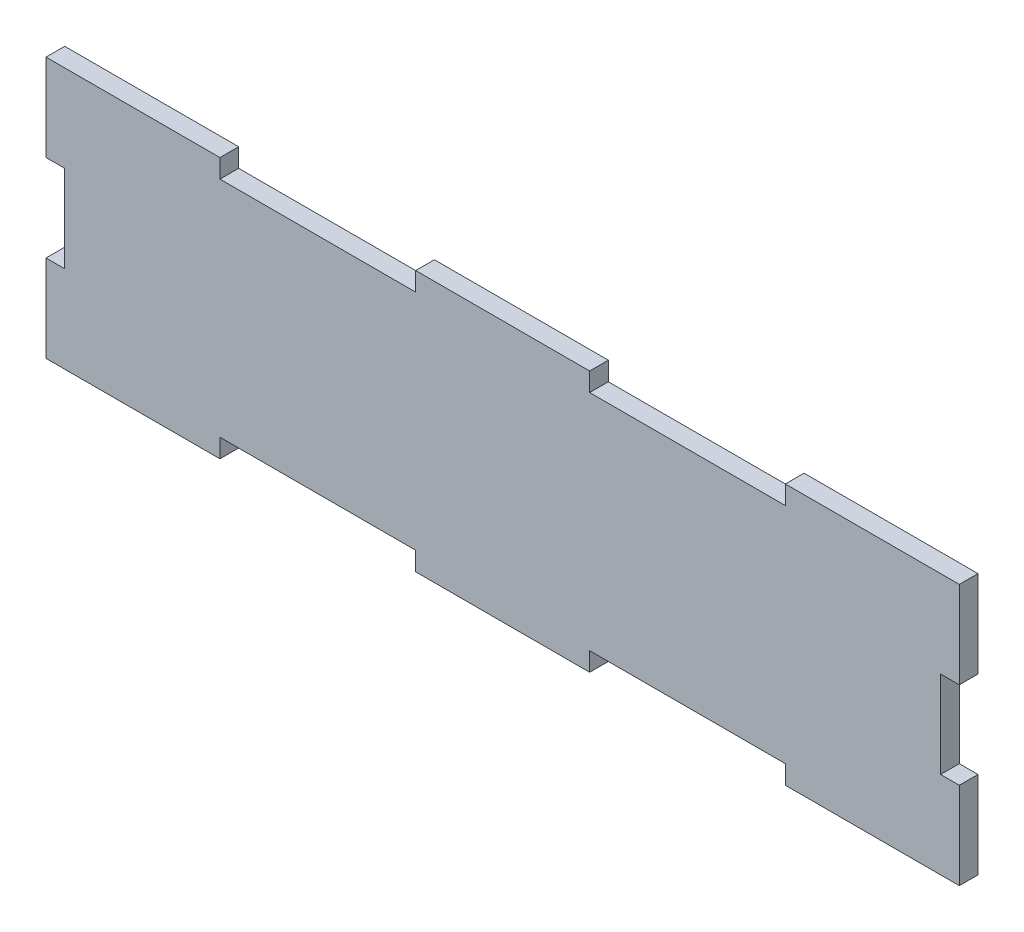
ISO-10303-21;
HEADER;
FILE_DESCRIPTION(('STEP AP214'),'2;1');
FILE_NAME('part.step','',(''),(''),'','','');
FILE_SCHEMA(('AUTOMOTIVE_DESIGN { 1 0 10303 214 1 1 1 1 }'));
ENDSEC;
DATA;
#1=APPLICATION_CONTEXT('core data for automotive mechanical design processes');
#2=APPLICATION_PROTOCOL_DEFINITION('international standard','automotive_design',2000,#1);
#3=PRODUCT_CONTEXT('',#1,'mechanical');
#4=PRODUCT('Part','Part','',(#3));
#5=PRODUCT_RELATED_PRODUCT_CATEGORY('part','',(#4));
#6=PRODUCT_DEFINITION_FORMATION('','',#4);
#7=PRODUCT_DEFINITION_CONTEXT('part definition',#1,'design');
#8=PRODUCT_DEFINITION('design','',#6,#7);
#9=PRODUCT_DEFINITION_SHAPE('','',#8);
#10=(LENGTH_UNIT() NAMED_UNIT(*) SI_UNIT(.MILLI.,.METRE.));
#11=(NAMED_UNIT(*) PLANE_ANGLE_UNIT() SI_UNIT($,.RADIAN.));
#12=(NAMED_UNIT(*) SI_UNIT($,.STERADIAN.) SOLID_ANGLE_UNIT());
#13=UNCERTAINTY_MEASURE_WITH_UNIT(LENGTH_MEASURE(1.E-05),#10,'distance_accuracy_value','');
#14=(GEOMETRIC_REPRESENTATION_CONTEXT(3) GLOBAL_UNCERTAINTY_ASSIGNED_CONTEXT((#13)) GLOBAL_UNIT_ASSIGNED_CONTEXT((#10,
#11,#12)) REPRESENTATION_CONTEXT('',''));
#15=CARTESIAN_POINT('',(0.,0.,0.));
#16=DIRECTION('',(0.,0.,1.));
#17=DIRECTION('',(1.,0.,0.));
#18=AXIS2_PLACEMENT_3D('',#15,#16,#17);
#19=CARTESIAN_POINT('',(0.,0.,2.7305));
#20=DIRECTION('',(0.,0.,1.));
#21=DIRECTION('',(1.,0.,0.));
#22=AXIS2_PLACEMENT_3D('',#19,#20,#21);
#23=PLANE('',#22);
#24=DIRECTION('',(0.,1.,0.));
#25=VECTOR('',#24,1.);
#26=CARTESIAN_POINT('',(133.35,38.1,2.7305));
#27=LINE('',#26,#25);
#28=CARTESIAN_POINT('',(133.35,-38.1,2.7305));
#29=VERTEX_POINT('',#28);
#30=CARTESIAN_POINT('',(133.35,-12.7,2.7305));
#31=VERTEX_POINT('',#30);
#32=EDGE_CURVE('E346',#29,#31,#27,.T.);
#33=ORIENTED_EDGE('',*,*,#32,.T.);
#34=DIRECTION('',(-1.,0.,0.));
#35=VECTOR('',#34,1.);
#36=CARTESIAN_POINT('',(133.35,-12.7,2.7305));
#37=LINE('',#36,#35);
#38=CARTESIAN_POINT('',(127.889,-12.7,2.7305));
#39=VERTEX_POINT('',#38);
#40=EDGE_CURVE('E232',#31,#39,#37,.T.);
#41=ORIENTED_EDGE('',*,*,#40,.T.);
#42=DIRECTION('',(0.,1.,0.));
#43=VECTOR('',#42,1.);
#44=CARTESIAN_POINT('',(127.889,12.7,2.7305));
#45=LINE('',#44,#43);
#46=CARTESIAN_POINT('',(127.889,12.7,2.7305));
#47=VERTEX_POINT('',#46);
#48=EDGE_CURVE('E404',#39,#47,#45,.T.);
#49=ORIENTED_EDGE('',*,*,#48,.T.);
#50=DIRECTION('',(1.,0.,0.));
#51=VECTOR('',#50,1.);
#52=CARTESIAN_POINT('',(133.35,12.7,2.7305));
#53=LINE('',#52,#51);
#54=CARTESIAN_POINT('',(133.35,12.7,2.7305));
#55=VERTEX_POINT('',#54);
#56=EDGE_CURVE('E402',#47,#55,#53,.T.);
#57=ORIENTED_EDGE('',*,*,#56,.T.);
#58=CARTESIAN_POINT('',(133.35,38.1,2.7305));
#59=VERTEX_POINT('',#58);
#60=EDGE_CURVE('E240',#55,#59,#27,.T.);
#61=ORIENTED_EDGE('',*,*,#60,.T.);
#62=DIRECTION('',(-1.,0.,0.));
#63=VECTOR('',#62,1.);
#64=CARTESIAN_POINT('',(-133.35,38.1,2.7305));
#65=LINE('',#64,#63);
#66=CARTESIAN_POINT('',(82.55,38.1,2.73050000000014));
#67=VERTEX_POINT('',#66);
#68=EDGE_CURVE('E350',#59,#67,#65,.T.);
#69=ORIENTED_EDGE('',*,*,#68,.T.);
#70=DIRECTION('',(0.,-1.,0.));
#71=VECTOR('',#70,1.);
#72=CARTESIAN_POINT('',(82.55,38.1,2.73050000000014));
#73=LINE('',#72,#71);
#74=CARTESIAN_POINT('',(82.55,32.639,2.73050000000013));
#75=VERTEX_POINT('',#74);
#76=EDGE_CURVE('E463',#67,#75,#73,.T.);
#77=ORIENTED_EDGE('',*,*,#76,.T.);
#78=DIRECTION('',(1.,0.,0.));
#79=VECTOR('',#78,1.);
#80=CARTESIAN_POINT('',(0.,32.639,2.73050000000013));
#81=LINE('',#80,#79);
#82=CARTESIAN_POINT('',(25.4,32.639,2.73050000000013));
#83=VERTEX_POINT('',#82);
#84=EDGE_CURVE('E458',#83,#75,#81,.T.);
#85=ORIENTED_EDGE('',*,*,#84,.F.);
#86=DIRECTION('',(0.,-1.,0.));
#87=VECTOR('',#86,1.);
#88=CARTESIAN_POINT('',(25.4,38.1,2.73050000000014));
#89=LINE('',#88,#87);
#90=CARTESIAN_POINT('',(25.4,38.1,2.73050000000014));
#91=VERTEX_POINT('',#90);
#92=EDGE_CURVE('E466',#91,#83,#89,.T.);
#93=ORIENTED_EDGE('',*,*,#92,.F.);
#94=CARTESIAN_POINT('',(-25.4,38.1,2.73050000000014));
#95=VERTEX_POINT('',#94);
#96=EDGE_CURVE('E353',#91,#95,#65,.T.);
#97=ORIENTED_EDGE('',*,*,#96,.T.);
#98=DIRECTION('',(0.,-1.,0.));
#99=VECTOR('',#98,1.);
#100=CARTESIAN_POINT('',(-25.4,38.1,2.73050000000014));
#101=LINE('',#100,#99);
#102=CARTESIAN_POINT('',(-25.4,32.639,2.73050000000013));
#103=VERTEX_POINT('',#102);
#104=EDGE_CURVE('E473',#95,#103,#101,.T.);
#105=ORIENTED_EDGE('',*,*,#104,.T.);
#106=DIRECTION('',(-1.,0.,0.));
#107=VECTOR('',#106,1.);
#108=CARTESIAN_POINT('',(0.,32.639,2.73050000000013));
#109=LINE('',#108,#107);
#110=CARTESIAN_POINT('',(-82.55,32.639,2.73050000000013));
#111=VERTEX_POINT('',#110);
#112=EDGE_CURVE('E449',#103,#111,#109,.T.);
#113=ORIENTED_EDGE('',*,*,#112,.T.);
#114=DIRECTION('',(0.,-1.,0.));
#115=VECTOR('',#114,1.);
#116=CARTESIAN_POINT('',(-82.55,38.1,2.73050000000014));
#117=LINE('',#116,#115);
#118=CARTESIAN_POINT('',(-82.55,38.1,2.73050000000014));
#119=VERTEX_POINT('',#118);
#120=EDGE_CURVE('E255',#119,#111,#117,.T.);
#121=ORIENTED_EDGE('',*,*,#120,.F.);
#122=CARTESIAN_POINT('',(-133.35,38.1,2.7305));
#123=VERTEX_POINT('',#122);
#124=EDGE_CURVE('E349',#119,#123,#65,.T.);
#125=ORIENTED_EDGE('',*,*,#124,.T.);
#126=DIRECTION('',(0.,-1.,0.));
#127=VECTOR('',#126,1.);
#128=CARTESIAN_POINT('',(-133.35,38.1,2.7305));
#129=LINE('',#128,#127);
#130=CARTESIAN_POINT('',(-133.35,12.7,2.7305));
#131=VERTEX_POINT('',#130);
#132=EDGE_CURVE('E354',#123,#131,#129,.T.);
#133=ORIENTED_EDGE('',*,*,#132,.T.);
#134=DIRECTION('',(-1.,0.,0.));
#135=VECTOR('',#134,1.);
#136=CARTESIAN_POINT('',(-133.35,12.7,2.7305));
#137=LINE('',#136,#135);
#138=CARTESIAN_POINT('',(-127.889,12.7,2.7305));
#139=VERTEX_POINT('',#138);
#140=EDGE_CURVE('E417',#139,#131,#137,.T.);
#141=ORIENTED_EDGE('',*,*,#140,.F.);
#142=DIRECTION('',(0.,1.,0.));
#143=VECTOR('',#142,1.);
#144=CARTESIAN_POINT('',(-127.889,12.7,2.7305));
#145=LINE('',#144,#143);
#146=CARTESIAN_POINT('',(-127.889,-12.7,2.7305));
#147=VERTEX_POINT('',#146);
#148=EDGE_CURVE('E424',#147,#139,#145,.T.);
#149=ORIENTED_EDGE('',*,*,#148,.F.);
#150=DIRECTION('',(1.,0.,0.));
#151=VECTOR('',#150,1.);
#152=CARTESIAN_POINT('',(-133.35,-12.7,2.7305));
#153=LINE('',#152,#151);
#154=CARTESIAN_POINT('',(-133.35,-12.7,2.7305));
#155=VERTEX_POINT('',#154);
#156=EDGE_CURVE('E369',#155,#147,#153,.T.);
#157=ORIENTED_EDGE('',*,*,#156,.F.);
#158=CARTESIAN_POINT('',(-133.35,-38.1,2.7305));
#159=VERTEX_POINT('',#158);
#160=EDGE_CURVE('E352',#155,#159,#129,.T.);
#161=ORIENTED_EDGE('',*,*,#160,.T.);
#162=DIRECTION('',(1.,0.,0.));
#163=VECTOR('',#162,1.);
#164=CARTESIAN_POINT('',(-133.35,-38.1,2.7305));
#165=LINE('',#164,#163);
#166=CARTESIAN_POINT('',(-82.55,-38.1,2.73050000000015));
#167=VERTEX_POINT('',#166);
#168=EDGE_CURVE('E259',#159,#167,#165,.T.);
#169=ORIENTED_EDGE('',*,*,#168,.T.);
#170=DIRECTION('',(0.,-1.,0.));
#171=VECTOR('',#170,1.);
#172=CARTESIAN_POINT('',(-82.55,-32.639,2.73050000000013));
#173=LINE('',#172,#171);
#174=CARTESIAN_POINT('',(-82.55,-32.639,2.73050000000013));
#175=VERTEX_POINT('',#174);
#176=EDGE_CURVE('E342',#175,#167,#173,.T.);
#177=ORIENTED_EDGE('',*,*,#176,.F.);
#178=DIRECTION('',(-1.,0.,0.));
#179=VECTOR('',#178,1.);
#180=CARTESIAN_POINT('',(0.,-32.639,2.73050000000013));
#181=LINE('',#180,#179);
#182=CARTESIAN_POINT('',(-25.4,-32.639,2.73050000000013));
#183=VERTEX_POINT('',#182);
#184=EDGE_CURVE('E309',#183,#175,#181,.T.);
#185=ORIENTED_EDGE('',*,*,#184,.F.);
#186=DIRECTION('',(0.,-1.,0.));
#187=VECTOR('',#186,1.);
#188=CARTESIAN_POINT('',(-25.4,-32.639,2.73050000000013));
#189=LINE('',#188,#187);
#190=CARTESIAN_POINT('',(-25.4,-38.1,2.73050000000015));
#191=VERTEX_POINT('',#190);
#192=EDGE_CURVE('E307',#183,#191,#189,.T.);
#193=ORIENTED_EDGE('',*,*,#192,.T.);
#194=CARTESIAN_POINT('',(25.4,-38.1,2.73050000000015));
#195=VERTEX_POINT('',#194);
#196=EDGE_CURVE('E360',#191,#195,#165,.T.);
#197=ORIENTED_EDGE('',*,*,#196,.T.);
#198=DIRECTION('',(0.,-1.,0.));
#199=VECTOR('',#198,1.);
#200=CARTESIAN_POINT('',(25.4,-32.639,2.73050000000013));
#201=LINE('',#200,#199);
#202=CARTESIAN_POINT('',(25.4,-32.639,2.73050000000013));
#203=VERTEX_POINT('',#202);
#204=EDGE_CURVE('E336',#203,#195,#201,.T.);
#205=ORIENTED_EDGE('',*,*,#204,.F.);
#206=DIRECTION('',(1.,0.,0.));
#207=VECTOR('',#206,1.);
#208=CARTESIAN_POINT('',(0.,-32.639,2.73050000000013));
#209=LINE('',#208,#207);
#210=CARTESIAN_POINT('',(82.55,-32.639,2.73050000000013));
#211=VERTEX_POINT('',#210);
#212=EDGE_CURVE('E311',#203,#211,#209,.T.);
#213=ORIENTED_EDGE('',*,*,#212,.T.);
#214=DIRECTION('',(0.,-1.,0.));
#215=VECTOR('',#214,1.);
#216=CARTESIAN_POINT('',(82.55,-32.639,2.73050000000013));
#217=LINE('',#216,#215);
#218=CARTESIAN_POINT('',(82.55,-38.1,2.73050000000015));
#219=VERTEX_POINT('',#218);
#220=EDGE_CURVE('E333',#211,#219,#217,.T.);
#221=ORIENTED_EDGE('',*,*,#220,.T.);
#222=EDGE_CURVE('E356',#219,#29,#165,.T.);
#223=ORIENTED_EDGE('',*,*,#222,.T.);
#224=EDGE_LOOP('',(#33,#41,#49,#57,#61,#69,#77,#85,#93,#97,#105,#113,#121,#125,#133,#141,#149,
#157,#161,#169,#177,#185,#193,#197,#205,#213,#221,#223));
#225=FACE_BOUND('',#224,.T.);
#226=ADVANCED_FACE('F41',(#225),#23,.T.);
#227=CARTESIAN_POINT('',(133.35,38.1,2.7305));
#228=DIRECTION('',(-1.,0.,0.));
#229=DIRECTION('',(0.,0.,1.));
#230=AXIS2_PLACEMENT_3D('',#227,#228,#229);
#231=PLANE('',#230);
#232=DIRECTION('',(0.,0.,1.));
#233=VECTOR('',#232,1.);
#234=CARTESIAN_POINT('',(133.35,-12.7,-2.7305));
#235=LINE('',#234,#233);
#236=CARTESIAN_POINT('',(133.35,-12.7,-2.7305));
#237=VERTEX_POINT('',#236);
#238=EDGE_CURVE('E409',#237,#31,#235,.T.);
#239=ORIENTED_EDGE('',*,*,#238,.T.);
#240=ORIENTED_EDGE('',*,*,#32,.F.);
#241=DIRECTION('',(0.,0.,-1.));
#242=VECTOR('',#241,1.);
#243=CARTESIAN_POINT('',(133.35,-38.1,2.7305));
#244=LINE('',#243,#242);
#245=CARTESIAN_POINT('',(133.35,-38.1,-2.7305));
#246=VERTEX_POINT('',#245);
#247=EDGE_CURVE('E272',#29,#246,#244,.T.);
#248=ORIENTED_EDGE('',*,*,#247,.T.);
#249=DIRECTION('',(0.,1.,0.));
#250=VECTOR('',#249,1.);
#251=CARTESIAN_POINT('',(133.35,38.1,-2.7305));
#252=LINE('',#251,#250);
#253=EDGE_CURVE('E249',#246,#237,#252,.T.);
#254=ORIENTED_EDGE('',*,*,#253,.T.);
#255=EDGE_LOOP('',(#239,#240,#248,#254));
#256=FACE_BOUND('',#255,.T.);
#257=ADVANCED_FACE('F43',(#256),#231,.F.);
#258=DIRECTION('',(0.,0.,1.));
#259=VECTOR('',#258,1.);
#260=CARTESIAN_POINT('',(133.35,12.7,-2.7305));
#261=LINE('',#260,#259);
#262=CARTESIAN_POINT('',(133.35,12.7,-2.7305));
#263=VERTEX_POINT('',#262);
#264=EDGE_CURVE('E226',#263,#55,#261,.T.);
#265=ORIENTED_EDGE('',*,*,#264,.F.);
#266=CARTESIAN_POINT('',(133.35,38.1,-2.7305));
#267=VERTEX_POINT('',#266);
#268=EDGE_CURVE('E238',#263,#267,#252,.T.);
#269=ORIENTED_EDGE('',*,*,#268,.T.);
#270=DIRECTION('',(0.,0.,-1.));
#271=VECTOR('',#270,1.);
#272=CARTESIAN_POINT('',(133.35,38.1,2.7305));
#273=LINE('',#272,#271);
#274=EDGE_CURVE('E281',#59,#267,#273,.T.);
#275=ORIENTED_EDGE('',*,*,#274,.F.);
#276=ORIENTED_EDGE('',*,*,#60,.F.);
#277=EDGE_LOOP('',(#265,#269,#275,#276));
#278=FACE_BOUND('',#277,.T.);
#279=ADVANCED_FACE('F236',(#278),#231,.F.);
#280=CARTESIAN_POINT('',(0.,0.,-2.7305));
#281=DIRECTION('',(0.,0.,1.));
#282=DIRECTION('',(1.,0.,0.));
#283=AXIS2_PLACEMENT_3D('',#280,#281,#282);
#284=PLANE('',#283);
#285=DIRECTION('',(-1.,0.,0.));
#286=VECTOR('',#285,1.);
#287=CARTESIAN_POINT('',(133.35,-12.7,-2.7305));
#288=LINE('',#287,#286);
#289=CARTESIAN_POINT('',(127.889,-12.7,-2.7305));
#290=VERTEX_POINT('',#289);
#291=EDGE_CURVE('E241',#237,#290,#288,.T.);
#292=ORIENTED_EDGE('',*,*,#291,.F.);
#293=ORIENTED_EDGE('',*,*,#253,.F.);
#294=DIRECTION('',(1.,0.,0.));
#295=VECTOR('',#294,1.);
#296=CARTESIAN_POINT('',(-133.35,-38.1,-2.7305));
#297=LINE('',#296,#295);
#298=CARTESIAN_POINT('',(82.55,-38.1,-2.73049999999984));
#299=VERTEX_POINT('',#298);
#300=EDGE_CURVE('E267',#299,#246,#297,.T.);
#301=ORIENTED_EDGE('',*,*,#300,.F.);
#302=DIRECTION('',(0.,-1.,0.));
#303=VECTOR('',#302,1.);
#304=CARTESIAN_POINT('',(82.55,-32.639,-2.73049999999986));
#305=LINE('',#304,#303);
#306=CARTESIAN_POINT('',(82.55,-32.639,-2.73049999999986));
#307=VERTEX_POINT('',#306);
#308=EDGE_CURVE('E321',#307,#299,#305,.T.);
#309=ORIENTED_EDGE('',*,*,#308,.F.);
#310=DIRECTION('',(-1.,0.,0.));
#311=VECTOR('',#310,1.);
#312=CARTESIAN_POINT('',(0.,-32.639,-2.7305));
#313=LINE('',#312,#311);
#314=CARTESIAN_POINT('',(25.4,-32.639,-2.7305));
#315=VERTEX_POINT('',#314);
#316=EDGE_CURVE('E283',#307,#315,#313,.T.);
#317=ORIENTED_EDGE('',*,*,#316,.T.);
#318=DIRECTION('',(0.,-1.,0.));
#319=VECTOR('',#318,1.);
#320=CARTESIAN_POINT('',(25.4,-32.639,-2.73049999999981));
#321=LINE('',#320,#319);
#322=CARTESIAN_POINT('',(25.4,-38.1,-2.73049999999979));
#323=VERTEX_POINT('',#322);
#324=EDGE_CURVE('E338',#315,#323,#321,.T.);
#325=ORIENTED_EDGE('',*,*,#324,.T.);
#326=CARTESIAN_POINT('',(-25.4,-38.1,-2.73049999999979));
#327=VERTEX_POINT('',#326);
#328=EDGE_CURVE('E271',#327,#323,#297,.T.);
#329=ORIENTED_EDGE('',*,*,#328,.F.);
#330=DIRECTION('',(0.,-1.,0.));
#331=VECTOR('',#330,1.);
#332=CARTESIAN_POINT('',(-25.4,-32.639,-2.73049999999981));
#333=LINE('',#332,#331);
#334=CARTESIAN_POINT('',(-25.4,-32.639,-2.73049999999981));
#335=VERTEX_POINT('',#334);
#336=EDGE_CURVE('E294',#335,#327,#333,.T.);
#337=ORIENTED_EDGE('',*,*,#336,.F.);
#338=CARTESIAN_POINT('',(-82.55,-32.639,-2.7305));
#339=VERTEX_POINT('',#338);
#340=EDGE_CURVE('E282',#335,#339,#313,.T.);
#341=ORIENTED_EDGE('',*,*,#340,.T.);
#342=DIRECTION('',(0.,-1.,0.));
#343=VECTOR('',#342,1.);
#344=CARTESIAN_POINT('',(-82.55,-32.639,-2.73049999999986));
#345=LINE('',#344,#343);
#346=CARTESIAN_POINT('',(-82.55,-38.1,-2.73049999999984));
#347=VERTEX_POINT('',#346);
#348=EDGE_CURVE('E292',#339,#347,#345,.T.);
#349=ORIENTED_EDGE('',*,*,#348,.T.);
#350=CARTESIAN_POINT('',(-133.35,-38.1,-2.7305));
#351=VERTEX_POINT('',#350);
#352=EDGE_CURVE('E268',#351,#347,#297,.T.);
#353=ORIENTED_EDGE('',*,*,#352,.F.);
#354=DIRECTION('',(0.,-1.,0.));
#355=VECTOR('',#354,1.);
#356=CARTESIAN_POINT('',(-133.35,38.1,-2.7305));
#357=LINE('',#356,#355);
#358=CARTESIAN_POINT('',(-133.35,-12.7,-2.7305));
#359=VERTEX_POINT('',#358);
#360=EDGE_CURVE('E262',#359,#351,#357,.T.);
#361=ORIENTED_EDGE('',*,*,#360,.F.);
#362=DIRECTION('',(1.,0.,0.));
#363=VECTOR('',#362,1.);
#364=CARTESIAN_POINT('',(-133.35,-12.7,-2.7305));
#365=LINE('',#364,#363);
#366=CARTESIAN_POINT('',(-127.889,-12.7,-2.7305));
#367=VERTEX_POINT('',#366);
#368=EDGE_CURVE('E414',#359,#367,#365,.T.);
#369=ORIENTED_EDGE('',*,*,#368,.T.);
#370=DIRECTION('',(0.,1.,0.));
#371=VECTOR('',#370,1.);
#372=CARTESIAN_POINT('',(-127.889,12.7,-2.7305));
#373=LINE('',#372,#371);
#374=CARTESIAN_POINT('',(-127.889,12.7,-2.7305));
#375=VERTEX_POINT('',#374);
#376=EDGE_CURVE('E64',#367,#375,#373,.T.);
#377=ORIENTED_EDGE('',*,*,#376,.T.);
#378=DIRECTION('',(-1.,0.,0.));
#379=VECTOR('',#378,1.);
#380=CARTESIAN_POINT('',(-133.35,12.7,-2.7305));
#381=LINE('',#380,#379);
#382=CARTESIAN_POINT('',(-133.35,12.7,-2.7305));
#383=VERTEX_POINT('',#382);
#384=EDGE_CURVE('E419',#375,#383,#381,.T.);
#385=ORIENTED_EDGE('',*,*,#384,.T.);
#386=CARTESIAN_POINT('',(-133.35,38.1,-2.7305));
#387=VERTEX_POINT('',#386);
#388=EDGE_CURVE('E264',#387,#383,#357,.T.);
#389=ORIENTED_EDGE('',*,*,#388,.F.);
#390=DIRECTION('',(-1.,0.,0.));
#391=VECTOR('',#390,1.);
#392=CARTESIAN_POINT('',(-133.35,38.1,-2.7305));
#393=LINE('',#392,#391);
#394=CARTESIAN_POINT('',(-82.55,38.1,-2.73049999999984));
#395=VERTEX_POINT('',#394);
#396=EDGE_CURVE('E253',#395,#387,#393,.T.);
#397=ORIENTED_EDGE('',*,*,#396,.F.);
#398=DIRECTION('',(0.,-1.,0.));
#399=VECTOR('',#398,1.);
#400=CARTESIAN_POINT('',(-82.55,38.1,-2.73049999999984));
#401=LINE('',#400,#399);
#402=CARTESIAN_POINT('',(-82.55,32.639,-2.73049999999986));
#403=VERTEX_POINT('',#402);
#404=EDGE_CURVE('E250',#395,#403,#401,.T.);
#405=ORIENTED_EDGE('',*,*,#404,.T.);
#406=DIRECTION('',(-1.,0.,0.));
#407=VECTOR('',#406,1.);
#408=CARTESIAN_POINT('',(0.,32.639,-2.7305));
#409=LINE('',#408,#407);
#410=CARTESIAN_POINT('',(-25.4,32.639,-2.7305));
#411=VERTEX_POINT('',#410);
#412=EDGE_CURVE('E49',#411,#403,#409,.T.);
#413=ORIENTED_EDGE('',*,*,#412,.F.);
#414=DIRECTION('',(0.,-1.,0.));
#415=VECTOR('',#414,1.);
#416=CARTESIAN_POINT('',(-25.4,38.1,-2.73049999999979));
#417=LINE('',#416,#415);
#418=CARTESIAN_POINT('',(-25.4,38.1,-2.73049999999979));
#419=VERTEX_POINT('',#418);
#420=EDGE_CURVE('E471',#419,#411,#417,.T.);
#421=ORIENTED_EDGE('',*,*,#420,.F.);
#422=CARTESIAN_POINT('',(25.4,38.1,-2.73049999999979));
#423=VERTEX_POINT('',#422);
#424=EDGE_CURVE('E263',#423,#419,#393,.T.);
#425=ORIENTED_EDGE('',*,*,#424,.F.);
#426=DIRECTION('',(0.,-1.,0.));
#427=VECTOR('',#426,1.);
#428=CARTESIAN_POINT('',(25.4,38.1,-2.73049999999979));
#429=LINE('',#428,#427);
#430=CARTESIAN_POINT('',(25.4,32.639,-2.73049999999981));
#431=VERTEX_POINT('',#430);
#432=EDGE_CURVE('E468',#423,#431,#429,.T.);
#433=ORIENTED_EDGE('',*,*,#432,.T.);
#434=CARTESIAN_POINT('',(82.55,32.639,-2.7305));
#435=VERTEX_POINT('',#434);
#436=EDGE_CURVE('E12',#435,#431,#409,.T.);
#437=ORIENTED_EDGE('',*,*,#436,.F.);
#438=DIRECTION('',(0.,-1.,0.));
#439=VECTOR('',#438,1.);
#440=CARTESIAN_POINT('',(82.55,38.1,-2.73049999999984));
#441=LINE('',#440,#439);
#442=CARTESIAN_POINT('',(82.55,38.1,-2.73049999999984));
#443=VERTEX_POINT('',#442);
#444=EDGE_CURVE('E446',#443,#435,#441,.T.);
#445=ORIENTED_EDGE('',*,*,#444,.F.);
#446=EDGE_CURVE('E247',#267,#443,#393,.T.);
#447=ORIENTED_EDGE('',*,*,#446,.F.);
#448=ORIENTED_EDGE('',*,*,#268,.F.);
#449=DIRECTION('',(1.,0.,0.));
#450=VECTOR('',#449,1.);
#451=CARTESIAN_POINT('',(133.35,12.7,-2.7305));
#452=LINE('',#451,#450);
#453=CARTESIAN_POINT('',(127.889,12.7,-2.7305));
#454=VERTEX_POINT('',#453);
#455=EDGE_CURVE('E223',#454,#263,#452,.T.);
#456=ORIENTED_EDGE('',*,*,#455,.F.);
#457=DIRECTION('',(0.,1.,0.));
#458=VECTOR('',#457,1.);
#459=CARTESIAN_POINT('',(127.889,12.7,-2.7305));
#460=LINE('',#459,#458);
#461=EDGE_CURVE('E231',#290,#454,#460,.T.);
#462=ORIENTED_EDGE('',*,*,#461,.F.);
#463=EDGE_LOOP('',(#292,#293,#301,#309,#317,#325,#329,#337,#341,#349,#353,#361,#369,#377,#385,
#389,#397,#405,#413,#421,#425,#433,#437,#445,#447,#448,#456,#462));
#464=FACE_BOUND('',#463,.T.);
#465=ADVANCED_FACE('F244',(#464),#284,.F.);
#466=CARTESIAN_POINT('',(-133.35,38.1,2.7305));
#467=DIRECTION('',(1.,0.,0.));
#468=DIRECTION('',(0.,1.,0.));
#469=AXIS2_PLACEMENT_3D('',#466,#467,#468);
#470=PLANE('',#469);
#471=ORIENTED_EDGE('',*,*,#388,.T.);
#472=DIRECTION('',(0.,0.,1.));
#473=VECTOR('',#472,1.);
#474=CARTESIAN_POINT('',(-133.35,12.7,-2.7305));
#475=LINE('',#474,#473);
#476=EDGE_CURVE('E325',#383,#131,#475,.T.);
#477=ORIENTED_EDGE('',*,*,#476,.T.);
#478=ORIENTED_EDGE('',*,*,#132,.F.);
#479=DIRECTION('',(0.,0.,-1.));
#480=VECTOR('',#479,1.);
#481=CARTESIAN_POINT('',(-133.35,38.1,2.7305));
#482=LINE('',#481,#480);
#483=EDGE_CURVE('E278',#123,#387,#482,.T.);
#484=ORIENTED_EDGE('',*,*,#483,.T.);
#485=EDGE_LOOP('',(#471,#477,#478,#484));
#486=FACE_BOUND('',#485,.T.);
#487=ADVANCED_FACE('F502',(#486),#470,.F.);
#488=CARTESIAN_POINT('',(-133.35,38.1,2.7305));
#489=DIRECTION('',(0.,-1.,0.));
#490=DIRECTION('',(0.,0.,-1.));
#491=AXIS2_PLACEMENT_3D('',#488,#489,#490);
#492=PLANE('',#491);
#493=DIRECTION('',(0.,0.,-1.));
#494=VECTOR('',#493,1.);
#495=CARTESIAN_POINT('',(-25.4,38.1,-6.79449999999986));
#496=LINE('',#495,#494);
#497=EDGE_CURVE('E438',#95,#419,#496,.T.);
#498=ORIENTED_EDGE('',*,*,#497,.F.);
#499=ORIENTED_EDGE('',*,*,#96,.F.);
#500=DIRECTION('',(0.,0.,-1.));
#501=VECTOR('',#500,1.);
#502=CARTESIAN_POINT('',(25.4,38.1,-6.79449999999986));
#503=LINE('',#502,#501);
#504=EDGE_CURVE('E441',#91,#423,#503,.T.);
#505=ORIENTED_EDGE('',*,*,#504,.T.);
#506=ORIENTED_EDGE('',*,*,#424,.T.);
#507=EDGE_LOOP('',(#498,#499,#505,#506));
#508=FACE_BOUND('',#507,.T.);
#509=ADVANCED_FACE('F494',(#508),#492,.F.);
#510=DIRECTION('',(0.,0.,-1.));
#511=VECTOR('',#510,1.);
#512=CARTESIAN_POINT('',(82.55,38.1,-6.79449999999986));
#513=LINE('',#512,#511);
#514=EDGE_CURVE('E444',#67,#443,#513,.T.);
#515=ORIENTED_EDGE('',*,*,#514,.F.);
#516=ORIENTED_EDGE('',*,*,#68,.F.);
#517=ORIENTED_EDGE('',*,*,#274,.T.);
#518=ORIENTED_EDGE('',*,*,#446,.T.);
#519=EDGE_LOOP('',(#515,#516,#517,#518));
#520=FACE_BOUND('',#519,.T.);
#521=ADVANCED_FACE('F535',(#520),#492,.F.);
#522=CARTESIAN_POINT('',(-133.35,-38.1,2.7305));
#523=DIRECTION('',(0.,1.,0.));
#524=DIRECTION('',(0.,0.,1.));
#525=AXIS2_PLACEMENT_3D('',#522,#523,#524);
#526=PLANE('',#525);
#527=DIRECTION('',(0.,0.,-1.));
#528=VECTOR('',#527,1.);
#529=CARTESIAN_POINT('',(25.4,-38.1,-6.79449999999985));
#530=LINE('',#529,#528);
#531=EDGE_CURVE('E327',#195,#323,#530,.T.);
#532=ORIENTED_EDGE('',*,*,#531,.F.);
#533=ORIENTED_EDGE('',*,*,#196,.F.);
#534=DIRECTION('',(0.,0.,-1.));
#535=VECTOR('',#534,1.);
#536=CARTESIAN_POINT('',(-25.4,-38.1,-6.79449999999985));
#537=LINE('',#536,#535);
#538=EDGE_CURVE('E324',#191,#327,#537,.T.);
#539=ORIENTED_EDGE('',*,*,#538,.T.);
#540=ORIENTED_EDGE('',*,*,#328,.T.);
#541=EDGE_LOOP('',(#532,#533,#539,#540));
#542=FACE_BOUND('',#541,.T.);
#543=ADVANCED_FACE('F382',(#542),#526,.F.);
#544=DIRECTION('',(0.,0.,-1.));
#545=VECTOR('',#544,1.);
#546=CARTESIAN_POINT('',(-82.55,-38.1,-6.79449999999985));
#547=LINE('',#546,#545);
#548=EDGE_CURVE('E322',#167,#347,#547,.T.);
#549=ORIENTED_EDGE('',*,*,#548,.F.);
#550=ORIENTED_EDGE('',*,*,#168,.F.);
#551=DIRECTION('',(0.,0.,-1.));
#552=VECTOR('',#551,1.);
#553=CARTESIAN_POINT('',(-133.35,-38.1,2.7305));
#554=LINE('',#553,#552);
#555=EDGE_CURVE('E275',#159,#351,#554,.T.);
#556=ORIENTED_EDGE('',*,*,#555,.T.);
#557=ORIENTED_EDGE('',*,*,#352,.T.);
#558=EDGE_LOOP('',(#549,#550,#556,#557));
#559=FACE_BOUND('',#558,.T.);
#560=ADVANCED_FACE('F376',(#559),#526,.F.);
#561=ORIENTED_EDGE('',*,*,#124,.F.);
#562=DIRECTION('',(0.,0.,-1.));
#563=VECTOR('',#562,1.);
#564=CARTESIAN_POINT('',(-82.55,38.1,-6.79449999999986));
#565=LINE('',#564,#563);
#566=EDGE_CURVE('E435',#119,#395,#565,.T.);
#567=ORIENTED_EDGE('',*,*,#566,.T.);
#568=ORIENTED_EDGE('',*,*,#396,.T.);
#569=ORIENTED_EDGE('',*,*,#483,.F.);
#570=EDGE_LOOP('',(#561,#567,#568,#569));
#571=FACE_BOUND('',#570,.T.);
#572=ADVANCED_FACE('F499',(#571),#492,.F.);
#573=ORIENTED_EDGE('',*,*,#160,.F.);
#574=DIRECTION('',(0.,0.,1.));
#575=VECTOR('',#574,1.);
#576=CARTESIAN_POINT('',(-133.35,-12.7,-2.7305));
#577=LINE('',#576,#575);
#578=EDGE_CURVE('E422',#359,#155,#577,.T.);
#579=ORIENTED_EDGE('',*,*,#578,.F.);
#580=ORIENTED_EDGE('',*,*,#360,.T.);
#581=ORIENTED_EDGE('',*,*,#555,.F.);
#582=EDGE_LOOP('',(#573,#579,#580,#581));
#583=FACE_BOUND('',#582,.T.);
#584=ADVANCED_FACE('F372',(#583),#470,.F.);
#585=ORIENTED_EDGE('',*,*,#222,.F.);
#586=DIRECTION('',(0.,0.,-1.));
#587=VECTOR('',#586,1.);
#588=CARTESIAN_POINT('',(82.55,-38.1,-6.79449999999985));
#589=LINE('',#588,#587);
#590=EDGE_CURVE('E329',#219,#299,#589,.T.);
#591=ORIENTED_EDGE('',*,*,#590,.T.);
#592=ORIENTED_EDGE('',*,*,#300,.T.);
#593=ORIENTED_EDGE('',*,*,#247,.F.);
#594=EDGE_LOOP('',(#585,#591,#592,#593));
#595=FACE_BOUND('',#594,.T.);
#596=ADVANCED_FACE('F392',(#595),#526,.F.);
#597=CARTESIAN_POINT('',(0.,-32.639,-6.79449999999987));
#598=DIRECTION('',(0.,1.,0.));
#599=DIRECTION('',(1.,0.,0.));
#600=AXIS2_PLACEMENT_3D('',#597,#598,#599);
#601=PLANE('',#600);
#602=DIRECTION('',(0.,0.,-1.));
#603=VECTOR('',#602,1.);
#604=CARTESIAN_POINT('',(-25.4,-32.639,-6.79449999999987));
#605=LINE('',#604,#603);
#606=EDGE_CURVE('E300',#183,#335,#605,.T.);
#607=ORIENTED_EDGE('',*,*,#606,.F.);
#608=ORIENTED_EDGE('',*,*,#184,.T.);
#609=DIRECTION('',(0.,0.,-1.));
#610=VECTOR('',#609,1.);
#611=CARTESIAN_POINT('',(-82.55,-32.639,-6.79449999999987));
#612=LINE('',#611,#610);
#613=EDGE_CURVE('E302',#175,#339,#612,.T.);
#614=ORIENTED_EDGE('',*,*,#613,.T.);
#615=ORIENTED_EDGE('',*,*,#340,.F.);
#616=EDGE_LOOP('',(#607,#608,#614,#615));
#617=FACE_BOUND('',#616,.T.);
#618=ADVANCED_FACE('F298',(#617),#601,.F.);
#619=CARTESIAN_POINT('',(-25.4,-32.639,-6.79449999999987));
#620=DIRECTION('',(-1.,0.,0.));
#621=DIRECTION('',(0.,1.,0.));
#622=AXIS2_PLACEMENT_3D('',#619,#620,#621);
#623=PLANE('',#622);
#624=ORIENTED_EDGE('',*,*,#538,.F.);
#625=ORIENTED_EDGE('',*,*,#192,.F.);
#626=ORIENTED_EDGE('',*,*,#606,.T.);
#627=ORIENTED_EDGE('',*,*,#336,.T.);
#628=EDGE_LOOP('',(#624,#625,#626,#627));
#629=FACE_BOUND('',#628,.T.);
#630=ADVANCED_FACE('F304',(#629),#623,.T.);
#631=CARTESIAN_POINT('',(-82.55,-32.639,-6.79449999999987));
#632=DIRECTION('',(-1.,0.,0.));
#633=DIRECTION('',(0.,1.,0.));
#634=AXIS2_PLACEMENT_3D('',#631,#632,#633);
#635=PLANE('',#634);
#636=ORIENTED_EDGE('',*,*,#548,.T.);
#637=ORIENTED_EDGE('',*,*,#348,.F.);
#638=ORIENTED_EDGE('',*,*,#613,.F.);
#639=ORIENTED_EDGE('',*,*,#176,.T.);
#640=EDGE_LOOP('',(#636,#637,#638,#639));
#641=FACE_BOUND('',#640,.T.);
#642=ADVANCED_FACE('F527',(#641),#635,.F.);
#643=DIRECTION('',(0.,0.,-1.));
#644=VECTOR('',#643,1.);
#645=CARTESIAN_POINT('',(82.55,-32.639,-6.79449999999987));
#646=LINE('',#645,#644);
#647=EDGE_CURVE('E318',#211,#307,#646,.T.);
#648=ORIENTED_EDGE('',*,*,#647,.F.);
#649=ORIENTED_EDGE('',*,*,#212,.F.);
#650=DIRECTION('',(0.,0.,-1.));
#651=VECTOR('',#650,1.);
#652=CARTESIAN_POINT('',(25.4,-32.639,-6.79449999999987));
#653=LINE('',#652,#651);
#654=EDGE_CURVE('E308',#203,#315,#653,.T.);
#655=ORIENTED_EDGE('',*,*,#654,.T.);
#656=ORIENTED_EDGE('',*,*,#316,.F.);
#657=EDGE_LOOP('',(#648,#649,#655,#656));
#658=FACE_BOUND('',#657,.T.);
#659=ADVANCED_FACE('F555',(#658),#601,.F.);
#660=CARTESIAN_POINT('',(25.4,-32.639,-6.79449999999987));
#661=DIRECTION('',(-1.,0.,0.));
#662=DIRECTION('',(0.,1.,0.));
#663=AXIS2_PLACEMENT_3D('',#660,#661,#662);
#664=PLANE('',#663);
#665=ORIENTED_EDGE('',*,*,#531,.T.);
#666=ORIENTED_EDGE('',*,*,#324,.F.);
#667=ORIENTED_EDGE('',*,*,#654,.F.);
#668=ORIENTED_EDGE('',*,*,#204,.T.);
#669=EDGE_LOOP('',(#665,#666,#667,#668));
#670=FACE_BOUND('',#669,.T.);
#671=ADVANCED_FACE('F386',(#670),#664,.F.);
#672=CARTESIAN_POINT('',(82.55,-32.639,-6.79449999999987));
#673=DIRECTION('',(-1.,0.,0.));
#674=DIRECTION('',(0.,1.,0.));
#675=AXIS2_PLACEMENT_3D('',#672,#673,#674);
#676=PLANE('',#675);
#677=ORIENTED_EDGE('',*,*,#590,.F.);
#678=ORIENTED_EDGE('',*,*,#220,.F.);
#679=ORIENTED_EDGE('',*,*,#647,.T.);
#680=ORIENTED_EDGE('',*,*,#308,.T.);
#681=EDGE_LOOP('',(#677,#678,#679,#680));
#682=FACE_BOUND('',#681,.T.);
#683=ADVANCED_FACE('F553',(#682),#676,.T.);
#684=CARTESIAN_POINT('',(0.,32.639,-6.79449999999988));
#685=DIRECTION('',(0.,1.,0.));
#686=DIRECTION('',(1.,0.,0.));
#687=AXIS2_PLACEMENT_3D('',#684,#685,#686);
#688=PLANE('',#687);
#689=ORIENTED_EDGE('',*,*,#412,.T.);
#690=DIRECTION('',(0.,0.,-1.));
#691=VECTOR('',#690,1.);
#692=CARTESIAN_POINT('',(-82.55,32.639,-6.79449999999988));
#693=LINE('',#692,#691);
#694=EDGE_CURVE('E345',#111,#403,#693,.T.);
#695=ORIENTED_EDGE('',*,*,#694,.F.);
#696=ORIENTED_EDGE('',*,*,#112,.F.);
#697=DIRECTION('',(0.,0.,-1.));
#698=VECTOR('',#697,1.);
#699=CARTESIAN_POINT('',(-25.4,32.639,-6.79449999999988));
#700=LINE('',#699,#698);
#701=EDGE_CURVE('E452',#103,#411,#700,.T.);
#702=ORIENTED_EDGE('',*,*,#701,.T.);
#703=EDGE_LOOP('',(#689,#695,#696,#702));
#704=FACE_BOUND('',#703,.T.);
#705=ADVANCED_FACE('F483',(#704),#688,.T.);
#706=CARTESIAN_POINT('',(-25.4,38.1,-6.79449999999986));
#707=DIRECTION('',(-1.,0.,0.));
#708=DIRECTION('',(0.,1.,0.));
#709=AXIS2_PLACEMENT_3D('',#706,#707,#708);
#710=PLANE('',#709);
#711=ORIENTED_EDGE('',*,*,#701,.F.);
#712=ORIENTED_EDGE('',*,*,#104,.F.);
#713=ORIENTED_EDGE('',*,*,#497,.T.);
#714=ORIENTED_EDGE('',*,*,#420,.T.);
#715=EDGE_LOOP('',(#711,#712,#713,#714));
#716=FACE_BOUND('',#715,.T.);
#717=ADVANCED_FACE('F490',(#716),#710,.T.);
#718=CARTESIAN_POINT('',(-82.55,38.1,-6.79449999999986));
#719=DIRECTION('',(-1.,0.,0.));
#720=DIRECTION('',(0.,1.,0.));
#721=AXIS2_PLACEMENT_3D('',#718,#719,#720);
#722=PLANE('',#721);
#723=ORIENTED_EDGE('',*,*,#694,.T.);
#724=ORIENTED_EDGE('',*,*,#404,.F.);
#725=ORIENTED_EDGE('',*,*,#566,.F.);
#726=ORIENTED_EDGE('',*,*,#120,.T.);
#727=EDGE_LOOP('',(#723,#724,#725,#726));
#728=FACE_BOUND('',#727,.T.);
#729=ADVANCED_FACE('F479',(#728),#722,.F.);
#730=ORIENTED_EDGE('',*,*,#436,.T.);
#731=DIRECTION('',(0.,0.,-1.));
#732=VECTOR('',#731,1.);
#733=CARTESIAN_POINT('',(25.4,32.639,-6.79449999999988));
#734=LINE('',#733,#732);
#735=EDGE_CURVE('E455',#83,#431,#734,.T.);
#736=ORIENTED_EDGE('',*,*,#735,.F.);
#737=ORIENTED_EDGE('',*,*,#84,.T.);
#738=DIRECTION('',(0.,0.,-1.));
#739=VECTOR('',#738,1.);
#740=CARTESIAN_POINT('',(82.55,32.639,-6.79449999999988));
#741=LINE('',#740,#739);
#742=EDGE_CURVE('E439',#75,#435,#741,.T.);
#743=ORIENTED_EDGE('',*,*,#742,.T.);
#744=EDGE_LOOP('',(#730,#736,#737,#743));
#745=FACE_BOUND('',#744,.T.);
#746=ADVANCED_FACE('F576',(#745),#688,.T.);
#747=CARTESIAN_POINT('',(25.4,38.1,-6.79449999999986));
#748=DIRECTION('',(-1.,0.,0.));
#749=DIRECTION('',(0.,1.,0.));
#750=AXIS2_PLACEMENT_3D('',#747,#748,#749);
#751=PLANE('',#750);
#752=ORIENTED_EDGE('',*,*,#735,.T.);
#753=ORIENTED_EDGE('',*,*,#432,.F.);
#754=ORIENTED_EDGE('',*,*,#504,.F.);
#755=ORIENTED_EDGE('',*,*,#92,.T.);
#756=EDGE_LOOP('',(#752,#753,#754,#755));
#757=FACE_BOUND('',#756,.T.);
#758=ADVANCED_FACE('F583',(#757),#751,.F.);
#759=CARTESIAN_POINT('',(82.55,38.1,-6.79449999999986));
#760=DIRECTION('',(-1.,0.,0.));
#761=DIRECTION('',(0.,1.,0.));
#762=AXIS2_PLACEMENT_3D('',#759,#760,#761);
#763=PLANE('',#762);
#764=ORIENTED_EDGE('',*,*,#742,.F.);
#765=ORIENTED_EDGE('',*,*,#76,.F.);
#766=ORIENTED_EDGE('',*,*,#514,.T.);
#767=ORIENTED_EDGE('',*,*,#444,.T.);
#768=EDGE_LOOP('',(#764,#765,#766,#767));
#769=FACE_BOUND('',#768,.T.);
#770=ADVANCED_FACE('F589',(#769),#763,.T.);
#771=CARTESIAN_POINT('',(-133.35,12.7,-2.7305));
#772=DIRECTION('',(0.,1.,0.));
#773=DIRECTION('',(0.,0.,1.));
#774=AXIS2_PLACEMENT_3D('',#771,#772,#773);
#775=PLANE('',#774);
#776=ORIENTED_EDGE('',*,*,#140,.T.);
#777=ORIENTED_EDGE('',*,*,#476,.F.);
#778=ORIENTED_EDGE('',*,*,#384,.F.);
#779=DIRECTION('',(0.,0.,1.));
#780=VECTOR('',#779,1.);
#781=CARTESIAN_POINT('',(-127.889,12.7,-2.7305));
#782=LINE('',#781,#780);
#783=EDGE_CURVE('E430',#375,#139,#782,.T.);
#784=ORIENTED_EDGE('',*,*,#783,.T.);
#785=EDGE_LOOP('',(#776,#777,#778,#784));
#786=FACE_BOUND('',#785,.T.);
#787=ADVANCED_FACE('F505',(#786),#775,.F.);
#788=CARTESIAN_POINT('',(-127.889,12.7,-2.7305));
#789=DIRECTION('',(1.,0.,0.));
#790=DIRECTION('',(0.,0.,-1.));
#791=AXIS2_PLACEMENT_3D('',#788,#789,#790);
#792=PLANE('',#791);
#793=ORIENTED_EDGE('',*,*,#148,.T.);
#794=ORIENTED_EDGE('',*,*,#783,.F.);
#795=ORIENTED_EDGE('',*,*,#376,.F.);
#796=DIRECTION('',(0.,0.,1.));
#797=VECTOR('',#796,1.);
#798=CARTESIAN_POINT('',(-127.889,-12.7,-2.7305));
#799=LINE('',#798,#797);
#800=EDGE_CURVE('E432',#367,#147,#799,.T.);
#801=ORIENTED_EDGE('',*,*,#800,.T.);
#802=EDGE_LOOP('',(#793,#794,#795,#801));
#803=FACE_BOUND('',#802,.T.);
#804=ADVANCED_FACE('F506',(#803),#792,.F.);
#805=CARTESIAN_POINT('',(-133.35,-12.7,-2.7305));
#806=DIRECTION('',(0.,-1.,0.));
#807=DIRECTION('',(0.,0.,-1.));
#808=AXIS2_PLACEMENT_3D('',#805,#806,#807);
#809=PLANE('',#808);
#810=ORIENTED_EDGE('',*,*,#156,.T.);
#811=ORIENTED_EDGE('',*,*,#800,.F.);
#812=ORIENTED_EDGE('',*,*,#368,.F.);
#813=ORIENTED_EDGE('',*,*,#578,.T.);
#814=EDGE_LOOP('',(#810,#811,#812,#813));
#815=FACE_BOUND('',#814,.T.);
#816=ADVANCED_FACE('F508',(#815),#809,.F.);
#817=CARTESIAN_POINT('',(133.35,-12.7,-2.7305));
#818=DIRECTION('',(0.,1.,0.));
#819=DIRECTION('',(0.,0.,1.));
#820=AXIS2_PLACEMENT_3D('',#817,#818,#819);
#821=PLANE('',#820);
#822=ORIENTED_EDGE('',*,*,#40,.F.);
#823=ORIENTED_EDGE('',*,*,#238,.F.);
#824=ORIENTED_EDGE('',*,*,#291,.T.);
#825=DIRECTION('',(0.,0.,1.));
#826=VECTOR('',#825,1.);
#827=CARTESIAN_POINT('',(127.889,-12.7,-2.7305));
#828=LINE('',#827,#826);
#829=EDGE_CURVE('E411',#290,#39,#828,.T.);
#830=ORIENTED_EDGE('',*,*,#829,.T.);
#831=EDGE_LOOP('',(#822,#823,#824,#830));
#832=FACE_BOUND('',#831,.T.);
#833=ADVANCED_FACE('F510',(#832),#821,.T.);
#834=CARTESIAN_POINT('',(127.889,12.7,-2.7305));
#835=DIRECTION('',(1.,0.,0.));
#836=DIRECTION('',(0.,0.,-1.));
#837=AXIS2_PLACEMENT_3D('',#834,#835,#836);
#838=PLANE('',#837);
#839=ORIENTED_EDGE('',*,*,#48,.F.);
#840=ORIENTED_EDGE('',*,*,#829,.F.);
#841=ORIENTED_EDGE('',*,*,#461,.T.);
#842=DIRECTION('',(0.,0.,1.));
#843=VECTOR('',#842,1.);
#844=CARTESIAN_POINT('',(127.889,12.7,-2.7305));
#845=LINE('',#844,#843);
#846=EDGE_CURVE('E56',#454,#47,#845,.T.);
#847=ORIENTED_EDGE('',*,*,#846,.T.);
#848=EDGE_LOOP('',(#839,#840,#841,#847));
#849=FACE_BOUND('',#848,.T.);
#850=ADVANCED_FACE('F517',(#849),#838,.T.);
#851=CARTESIAN_POINT('',(133.35,12.7,-2.7305));
#852=DIRECTION('',(0.,-1.,0.));
#853=DIRECTION('',(0.,0.,-1.));
#854=AXIS2_PLACEMENT_3D('',#851,#852,#853);
#855=PLANE('',#854);
#856=ORIENTED_EDGE('',*,*,#56,.F.);
#857=ORIENTED_EDGE('',*,*,#846,.F.);
#858=ORIENTED_EDGE('',*,*,#455,.T.);
#859=ORIENTED_EDGE('',*,*,#264,.T.);
#860=EDGE_LOOP('',(#856,#857,#858,#859));
#861=FACE_BOUND('',#860,.T.);
#862=ADVANCED_FACE('F225',(#861),#855,.T.);
#863=CLOSED_SHELL('',(#226,#257,#279,#465,#487,#509,#521,#543,#560,#572,#584,#596,#618,#630,
#642,#659,#671,#683,#705,#717,#729,#746,#758,#770,#787,#804,#816,#833,#850,#862));
#864=MANIFOLD_SOLID_BREP('B2',#863);
#865=ADVANCED_BREP_SHAPE_REPRESENTATION('',(#18,#864),#14);
#866=SHAPE_DEFINITION_REPRESENTATION(#9,#865);
ENDSEC;
END-ISO-10303-21;
